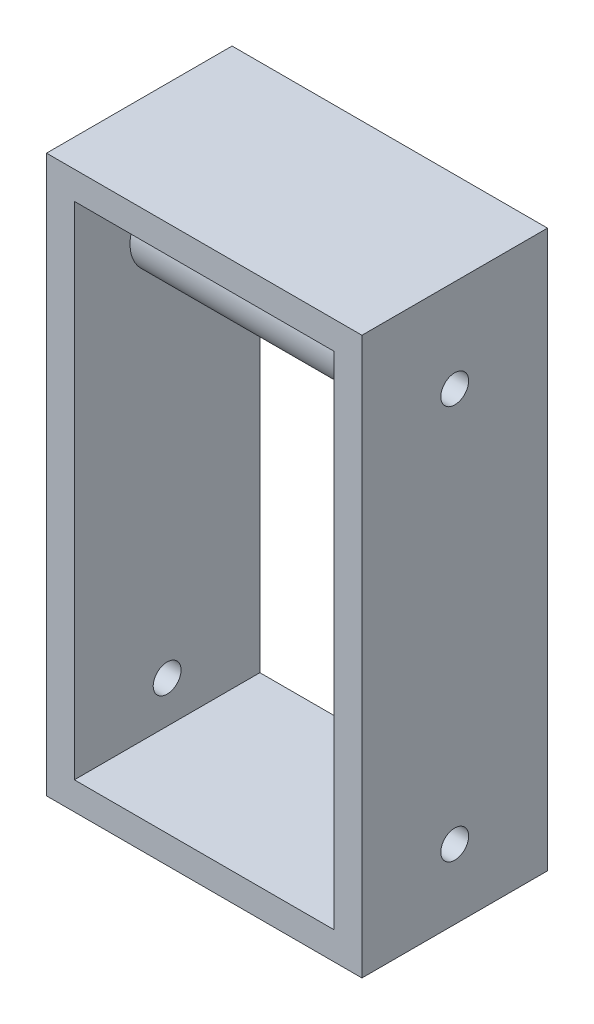
ISO-10303-21;
HEADER;
FILE_DESCRIPTION(('STEP AP214'),'2;1');
FILE_NAME('part.step','',(''),(''),'','','');
FILE_SCHEMA(('AUTOMOTIVE_DESIGN { 1 0 10303 214 1 1 1 1 }'));
ENDSEC;
DATA;
#1=APPLICATION_CONTEXT('core data for automotive mechanical design processes');
#2=APPLICATION_PROTOCOL_DEFINITION('international standard','automotive_design',2000,#1);
#3=PRODUCT_CONTEXT('',#1,'mechanical');
#4=PRODUCT('Part','Part','',(#3));
#5=PRODUCT_RELATED_PRODUCT_CATEGORY('part','',(#4));
#6=PRODUCT_DEFINITION_FORMATION('','',#4);
#7=PRODUCT_DEFINITION_CONTEXT('part definition',#1,'design');
#8=PRODUCT_DEFINITION('design','',#6,#7);
#9=PRODUCT_DEFINITION_SHAPE('','',#8);
#10=(LENGTH_UNIT() NAMED_UNIT(*) SI_UNIT(.MILLI.,.METRE.));
#11=(NAMED_UNIT(*) PLANE_ANGLE_UNIT() SI_UNIT($,.RADIAN.));
#12=(NAMED_UNIT(*) SI_UNIT($,.STERADIAN.) SOLID_ANGLE_UNIT());
#13=UNCERTAINTY_MEASURE_WITH_UNIT(LENGTH_MEASURE(1.E-05),#10,'distance_accuracy_value','');
#14=(GEOMETRIC_REPRESENTATION_CONTEXT(3) GLOBAL_UNCERTAINTY_ASSIGNED_CONTEXT((#13)) GLOBAL_UNIT_ASSIGNED_CONTEXT((#10,
#11,#12)) REPRESENTATION_CONTEXT('',''));
#15=CARTESIAN_POINT('',(0.,0.,0.));
#16=DIRECTION('',(0.,0.,1.));
#17=DIRECTION('',(1.,0.,0.));
#18=AXIS2_PLACEMENT_3D('',#15,#16,#17);
#19=CARTESIAN_POINT('',(0.,0.,20.));
#20=DIRECTION('',(0.,0.,1.));
#21=DIRECTION('',(1.,0.,0.));
#22=AXIS2_PLACEMENT_3D('',#19,#20,#21);
#23=PLANE('',#22);
#24=DIRECTION('',(0.,1.,0.));
#25=VECTOR('',#24,1.);
#26=CARTESIAN_POINT('',(17.,30.,20.));
#27=LINE('',#26,#25);
#28=CARTESIAN_POINT('',(17.,-30.,20.));
#29=VERTEX_POINT('',#28);
#30=CARTESIAN_POINT('',(17.,30.,20.));
#31=VERTEX_POINT('',#30);
#32=EDGE_CURVE('E156',#29,#31,#27,.T.);
#33=ORIENTED_EDGE('',*,*,#32,.T.);
#34=DIRECTION('',(-1.,0.,0.));
#35=VECTOR('',#34,1.);
#36=CARTESIAN_POINT('',(-17.,30.,20.));
#37=LINE('',#36,#35);
#38=CARTESIAN_POINT('',(-17.,30.,20.));
#39=VERTEX_POINT('',#38);
#40=EDGE_CURVE('E160',#31,#39,#37,.T.);
#41=ORIENTED_EDGE('',*,*,#40,.T.);
#42=DIRECTION('',(0.,-1.,0.));
#43=VECTOR('',#42,1.);
#44=CARTESIAN_POINT('',(-17.,30.,20.));
#45=LINE('',#44,#43);
#46=CARTESIAN_POINT('',(-17.,-30.,20.));
#47=VERTEX_POINT('',#46);
#48=EDGE_CURVE('E164',#39,#47,#45,.T.);
#49=ORIENTED_EDGE('',*,*,#48,.T.);
#50=DIRECTION('',(1.,0.,0.));
#51=VECTOR('',#50,1.);
#52=CARTESIAN_POINT('',(-17.,-30.,20.));
#53=LINE('',#52,#51);
#54=EDGE_CURVE('E167',#47,#29,#53,.T.);
#55=ORIENTED_EDGE('',*,*,#54,.T.);
#56=EDGE_LOOP('',(#33,#41,#49,#55));
#57=FACE_BOUND('',#56,.T.);
#58=DIRECTION('',(0.,-1.,0.));
#59=VECTOR('',#58,1.);
#60=CARTESIAN_POINT('',(-14.,27.,20.));
#61=LINE('',#60,#59);
#62=CARTESIAN_POINT('',(-14.,27.,20.));
#63=VERTEX_POINT('',#62);
#64=CARTESIAN_POINT('',(-14.,-27.,20.));
#65=VERTEX_POINT('',#64);
#66=EDGE_CURVE('E115',#63,#65,#61,.T.);
#67=ORIENTED_EDGE('',*,*,#66,.F.);
#68=DIRECTION('',(-1.,0.,0.));
#69=VECTOR('',#68,1.);
#70=CARTESIAN_POINT('',(-14.,27.,20.));
#71=LINE('',#70,#69);
#72=CARTESIAN_POINT('',(14.,27.,20.));
#73=VERTEX_POINT('',#72);
#74=EDGE_CURVE('E106',#73,#63,#71,.T.);
#75=ORIENTED_EDGE('',*,*,#74,.F.);
#76=DIRECTION('',(0.,1.,0.));
#77=VECTOR('',#76,1.);
#78=CARTESIAN_POINT('',(14.,27.,20.));
#79=LINE('',#78,#77);
#80=CARTESIAN_POINT('',(14.,-27.,20.));
#81=VERTEX_POINT('',#80);
#82=EDGE_CURVE('E132',#81,#73,#79,.T.);
#83=ORIENTED_EDGE('',*,*,#82,.F.);
#84=DIRECTION('',(1.,0.,0.));
#85=VECTOR('',#84,1.);
#86=CARTESIAN_POINT('',(-14.,-27.,20.));
#87=LINE('',#86,#85);
#88=EDGE_CURVE('E128',#65,#81,#87,.T.);
#89=ORIENTED_EDGE('',*,*,#88,.F.);
#90=EDGE_LOOP('',(#67,#75,#83,#89));
#91=FACE_BOUND('',#90,.T.);
#92=ADVANCED_FACE('F39',(#57,#91),#23,.T.);
#93=CARTESIAN_POINT('',(0.,0.,0.));
#94=DIRECTION('',(0.,0.,1.));
#95=DIRECTION('',(1.,0.,0.));
#96=AXIS2_PLACEMENT_3D('',#93,#94,#95);
#97=PLANE('',#96);
#98=DIRECTION('',(0.,1.,0.));
#99=VECTOR('',#98,1.);
#100=CARTESIAN_POINT('',(17.,30.,0.));
#101=LINE('',#100,#99);
#102=CARTESIAN_POINT('',(17.,-30.,0.));
#103=VERTEX_POINT('',#102);
#104=CARTESIAN_POINT('',(17.,30.,0.));
#105=VERTEX_POINT('',#104);
#106=EDGE_CURVE('E124',#103,#105,#101,.T.);
#107=ORIENTED_EDGE('',*,*,#106,.F.);
#108=DIRECTION('',(1.,0.,0.));
#109=VECTOR('',#108,1.);
#110=CARTESIAN_POINT('',(-17.,-30.,0.));
#111=LINE('',#110,#109);
#112=CARTESIAN_POINT('',(-17.,-30.,0.));
#113=VERTEX_POINT('',#112);
#114=EDGE_CURVE('E161',#113,#103,#111,.T.);
#115=ORIENTED_EDGE('',*,*,#114,.F.);
#116=DIRECTION('',(0.,-1.,0.));
#117=VECTOR('',#116,1.);
#118=CARTESIAN_POINT('',(-17.,30.,0.));
#119=LINE('',#118,#117);
#120=CARTESIAN_POINT('',(-17.,30.,0.));
#121=VERTEX_POINT('',#120);
#122=EDGE_CURVE('E177',#121,#113,#119,.T.);
#123=ORIENTED_EDGE('',*,*,#122,.F.);
#124=DIRECTION('',(-1.,0.,0.));
#125=VECTOR('',#124,1.);
#126=CARTESIAN_POINT('',(-17.,30.,0.));
#127=LINE('',#126,#125);
#128=EDGE_CURVE('E174',#105,#121,#127,.T.);
#129=ORIENTED_EDGE('',*,*,#128,.F.);
#130=EDGE_LOOP('',(#107,#115,#123,#129));
#131=FACE_BOUND('',#130,.T.);
#132=DIRECTION('',(-1.,0.,0.));
#133=VECTOR('',#132,1.);
#134=CARTESIAN_POINT('',(-14.,27.,0.));
#135=LINE('',#134,#133);
#136=CARTESIAN_POINT('',(14.,27.,0.));
#137=VERTEX_POINT('',#136);
#138=CARTESIAN_POINT('',(-14.,27.,0.));
#139=VERTEX_POINT('',#138);
#140=EDGE_CURVE('E64',#137,#139,#135,.T.);
#141=ORIENTED_EDGE('',*,*,#140,.T.);
#142=DIRECTION('',(0.,-1.,0.));
#143=VECTOR('',#142,1.);
#144=CARTESIAN_POINT('',(-14.,27.,0.));
#145=LINE('',#144,#143);
#146=CARTESIAN_POINT('',(-14.,-27.,0.));
#147=VERTEX_POINT('',#146);
#148=EDGE_CURVE('E122',#139,#147,#145,.T.);
#149=ORIENTED_EDGE('',*,*,#148,.T.);
#150=DIRECTION('',(1.,0.,0.));
#151=VECTOR('',#150,1.);
#152=CARTESIAN_POINT('',(-14.,-27.,0.));
#153=LINE('',#152,#151);
#154=CARTESIAN_POINT('',(14.,-27.,0.));
#155=VERTEX_POINT('',#154);
#156=EDGE_CURVE('E143',#147,#155,#153,.T.);
#157=ORIENTED_EDGE('',*,*,#156,.T.);
#158=DIRECTION('',(0.,1.,0.));
#159=VECTOR('',#158,1.);
#160=CARTESIAN_POINT('',(14.,27.,0.));
#161=LINE('',#160,#159);
#162=EDGE_CURVE('E116',#155,#137,#161,.T.);
#163=ORIENTED_EDGE('',*,*,#162,.T.);
#164=EDGE_LOOP('',(#141,#149,#157,#163));
#165=FACE_BOUND('',#164,.T.);
#166=ADVANCED_FACE('F201',(#131,#165),#97,.F.);
#167=CARTESIAN_POINT('',(17.,30.,20.));
#168=DIRECTION('',(-1.,0.,0.));
#169=DIRECTION('',(0.,-1.,0.));
#170=AXIS2_PLACEMENT_3D('',#167,#168,#169);
#171=PLANE('',#170);
#172=CARTESIAN_POINT('',(17.,-22.5,10.));
#173=DIRECTION('',(-1.,0.,0.));
#174=DIRECTION('',(0.,-1.,0.));
#175=AXIS2_PLACEMENT_3D('',#172,#173,#174);
#176=CIRCLE('',#175,1.5);
#177=CARTESIAN_POINT('',(17.,-24.,10.));
#178=VERTEX_POINT('',#177);
#179=EDGE_CURVE('E140',#178,#178,#176,.T.);
#180=ORIENTED_EDGE('',*,*,#179,.T.);
#181=EDGE_LOOP('',(#180));
#182=FACE_BOUND('',#181,.T.);
#183=CARTESIAN_POINT('',(17.,20.,10.));
#184=DIRECTION('',(-1.,0.,0.));
#185=DIRECTION('',(0.,-1.,0.));
#186=AXIS2_PLACEMENT_3D('',#183,#184,#185);
#187=CIRCLE('',#186,1.5);
#188=CARTESIAN_POINT('',(17.,18.5,10.));
#189=VERTEX_POINT('',#188);
#190=EDGE_CURVE('E298',#189,#189,#187,.T.);
#191=ORIENTED_EDGE('',*,*,#190,.T.);
#192=EDGE_LOOP('',(#191));
#193=FACE_BOUND('',#192,.T.);
#194=ORIENTED_EDGE('',*,*,#106,.T.);
#195=DIRECTION('',(0.,0.,-1.));
#196=VECTOR('',#195,1.);
#197=CARTESIAN_POINT('',(17.,30.,20.));
#198=LINE('',#197,#196);
#199=EDGE_CURVE('E11',#31,#105,#198,.T.);
#200=ORIENTED_EDGE('',*,*,#199,.F.);
#201=ORIENTED_EDGE('',*,*,#32,.F.);
#202=DIRECTION('',(0.,0.,-1.));
#203=VECTOR('',#202,1.);
#204=CARTESIAN_POINT('',(17.,-30.,20.));
#205=LINE('',#204,#203);
#206=EDGE_CURVE('E170',#29,#103,#205,.T.);
#207=ORIENTED_EDGE('',*,*,#206,.T.);
#208=EDGE_LOOP('',(#194,#200,#201,#207));
#209=FACE_BOUND('',#208,.T.);
#210=ADVANCED_FACE('F41',(#182,#193,#209),#171,.F.);
#211=CARTESIAN_POINT('',(-17.,30.,20.));
#212=DIRECTION('',(0.,-1.,0.));
#213=DIRECTION('',(0.,0.,-1.));
#214=AXIS2_PLACEMENT_3D('',#211,#212,#213);
#215=PLANE('',#214);
#216=ORIENTED_EDGE('',*,*,#128,.T.);
#217=DIRECTION('',(0.,0.,-1.));
#218=VECTOR('',#217,1.);
#219=CARTESIAN_POINT('',(-17.,30.,20.));
#220=LINE('',#219,#218);
#221=EDGE_CURVE('E49',#39,#121,#220,.T.);
#222=ORIENTED_EDGE('',*,*,#221,.F.);
#223=ORIENTED_EDGE('',*,*,#40,.F.);
#224=ORIENTED_EDGE('',*,*,#199,.T.);
#225=EDGE_LOOP('',(#216,#222,#223,#224));
#226=FACE_BOUND('',#225,.T.);
#227=ADVANCED_FACE('F211',(#226),#215,.F.);
#228=CARTESIAN_POINT('',(-17.,30.,20.));
#229=DIRECTION('',(1.,0.,0.));
#230=DIRECTION('',(0.,1.,0.));
#231=AXIS2_PLACEMENT_3D('',#228,#229,#230);
#232=PLANE('',#231);
#233=CARTESIAN_POINT('',(-17.,-22.5,10.));
#234=DIRECTION('',(1.,0.,0.));
#235=DIRECTION('',(0.,1.,0.));
#236=AXIS2_PLACEMENT_3D('',#233,#234,#235);
#237=CIRCLE('',#236,1.5);
#238=CARTESIAN_POINT('',(-17.,-21.,10.));
#239=VERTEX_POINT('',#238);
#240=EDGE_CURVE('E294',#239,#239,#237,.T.);
#241=ORIENTED_EDGE('',*,*,#240,.T.);
#242=EDGE_LOOP('',(#241));
#243=FACE_BOUND('',#242,.T.);
#244=CARTESIAN_POINT('',(-17.,20.,10.));
#245=DIRECTION('',(1.,0.,0.));
#246=DIRECTION('',(0.,1.,0.));
#247=AXIS2_PLACEMENT_3D('',#244,#245,#246);
#248=CIRCLE('',#247,1.5);
#249=CARTESIAN_POINT('',(-17.,21.5,10.));
#250=VERTEX_POINT('',#249);
#251=EDGE_CURVE('E287',#250,#250,#248,.T.);
#252=ORIENTED_EDGE('',*,*,#251,.T.);
#253=EDGE_LOOP('',(#252));
#254=FACE_BOUND('',#253,.T.);
#255=ORIENTED_EDGE('',*,*,#122,.T.);
#256=DIRECTION('',(0.,0.,-1.));
#257=VECTOR('',#256,1.);
#258=CARTESIAN_POINT('',(-17.,-30.,20.));
#259=LINE('',#258,#257);
#260=EDGE_CURVE('E185',#47,#113,#259,.T.);
#261=ORIENTED_EDGE('',*,*,#260,.F.);
#262=ORIENTED_EDGE('',*,*,#48,.F.);
#263=ORIENTED_EDGE('',*,*,#221,.T.);
#264=EDGE_LOOP('',(#255,#261,#262,#263));
#265=FACE_BOUND('',#264,.T.);
#266=ADVANCED_FACE('F195',(#243,#254,#265),#232,.F.);
#267=CARTESIAN_POINT('',(-17.,-30.,20.));
#268=DIRECTION('',(0.,1.,0.));
#269=DIRECTION('',(0.,0.,1.));
#270=AXIS2_PLACEMENT_3D('',#267,#268,#269);
#271=PLANE('',#270);
#272=ORIENTED_EDGE('',*,*,#114,.T.);
#273=ORIENTED_EDGE('',*,*,#206,.F.);
#274=ORIENTED_EDGE('',*,*,#54,.F.);
#275=ORIENTED_EDGE('',*,*,#260,.T.);
#276=EDGE_LOOP('',(#272,#273,#274,#275));
#277=FACE_BOUND('',#276,.T.);
#278=ADVANCED_FACE('F205',(#277),#271,.F.);
#279=CARTESIAN_POINT('',(-14.,27.,20.));
#280=DIRECTION('',(0.,-1.,0.));
#281=DIRECTION('',(0.,0.,-1.));
#282=AXIS2_PLACEMENT_3D('',#279,#280,#281);
#283=PLANE('',#282);
#284=ORIENTED_EDGE('',*,*,#140,.F.);
#285=DIRECTION('',(0.,0.,-1.));
#286=VECTOR('',#285,1.);
#287=CARTESIAN_POINT('',(14.,27.,20.));
#288=LINE('',#287,#286);
#289=EDGE_CURVE('E110',#73,#137,#288,.T.);
#290=ORIENTED_EDGE('',*,*,#289,.F.);
#291=ORIENTED_EDGE('',*,*,#74,.T.);
#292=DIRECTION('',(0.,0.,-1.));
#293=VECTOR('',#292,1.);
#294=CARTESIAN_POINT('',(-14.,27.,20.));
#295=LINE('',#294,#293);
#296=EDGE_CURVE('E109',#63,#139,#295,.T.);
#297=ORIENTED_EDGE('',*,*,#296,.T.);
#298=EDGE_LOOP('',(#284,#290,#291,#297));
#299=FACE_BOUND('',#298,.T.);
#300=ADVANCED_FACE('F108',(#299),#283,.T.);
#301=CARTESIAN_POINT('',(-14.,27.,20.));
#302=DIRECTION('',(1.,0.,0.));
#303=DIRECTION('',(0.,1.,0.));
#304=AXIS2_PLACEMENT_3D('',#301,#302,#303);
#305=PLANE('',#304);
#306=CARTESIAN_POINT('',(-14.,20.,10.));
#307=DIRECTION('',(1.,0.,0.));
#308=DIRECTION('',(0.,1.,0.));
#309=AXIS2_PLACEMENT_3D('',#306,#307,#308);
#310=CIRCLE('',#309,4.);
#311=CARTESIAN_POINT('',(-14.,24.,10.));
#312=VERTEX_POINT('',#311);
#313=EDGE_CURVE('E282',#312,#312,#310,.T.);
#314=ORIENTED_EDGE('',*,*,#313,.F.);
#315=EDGE_LOOP('',(#314));
#316=FACE_BOUND('',#315,.T.);
#317=CARTESIAN_POINT('',(-14.,-22.5,10.));
#318=DIRECTION('',(1.,0.,0.));
#319=DIRECTION('',(0.,1.,0.));
#320=AXIS2_PLACEMENT_3D('',#317,#318,#319);
#321=CIRCLE('',#320,1.5);
#322=CARTESIAN_POINT('',(-14.,-21.,10.));
#323=VERTEX_POINT('',#322);
#324=EDGE_CURVE('E305',#323,#323,#321,.T.);
#325=ORIENTED_EDGE('',*,*,#324,.F.);
#326=EDGE_LOOP('',(#325));
#327=FACE_BOUND('',#326,.T.);
#328=ORIENTED_EDGE('',*,*,#148,.F.);
#329=ORIENTED_EDGE('',*,*,#296,.F.);
#330=ORIENTED_EDGE('',*,*,#66,.T.);
#331=DIRECTION('',(0.,0.,-1.));
#332=VECTOR('',#331,1.);
#333=CARTESIAN_POINT('',(-14.,-27.,20.));
#334=LINE('',#333,#332);
#335=EDGE_CURVE('E125',#65,#147,#334,.T.);
#336=ORIENTED_EDGE('',*,*,#335,.T.);
#337=EDGE_LOOP('',(#328,#329,#330,#336));
#338=FACE_BOUND('',#337,.T.);
#339=ADVANCED_FACE('F119',(#316,#327,#338),#305,.T.);
#340=CARTESIAN_POINT('',(-14.,-27.,20.));
#341=DIRECTION('',(0.,1.,0.));
#342=DIRECTION('',(0.,0.,1.));
#343=AXIS2_PLACEMENT_3D('',#340,#341,#342);
#344=PLANE('',#343);
#345=ORIENTED_EDGE('',*,*,#156,.F.);
#346=ORIENTED_EDGE('',*,*,#335,.F.);
#347=ORIENTED_EDGE('',*,*,#88,.T.);
#348=DIRECTION('',(0.,0.,-1.));
#349=VECTOR('',#348,1.);
#350=CARTESIAN_POINT('',(14.,-27.,20.));
#351=LINE('',#350,#349);
#352=EDGE_CURVE('E56',#81,#155,#351,.T.);
#353=ORIENTED_EDGE('',*,*,#352,.T.);
#354=EDGE_LOOP('',(#345,#346,#347,#353));
#355=FACE_BOUND('',#354,.T.);
#356=ADVANCED_FACE('F237',(#355),#344,.T.);
#357=CARTESIAN_POINT('',(14.,27.,20.));
#358=DIRECTION('',(-1.,0.,0.));
#359=DIRECTION('',(0.,-1.,0.));
#360=AXIS2_PLACEMENT_3D('',#357,#358,#359);
#361=PLANE('',#360);
#362=CARTESIAN_POINT('',(14.,20.,10.));
#363=DIRECTION('',(-1.,0.,0.));
#364=DIRECTION('',(0.,-1.,0.));
#365=AXIS2_PLACEMENT_3D('',#362,#363,#364);
#366=CIRCLE('',#365,4.);
#367=CARTESIAN_POINT('',(14.,16.,10.));
#368=VERTEX_POINT('',#367);
#369=EDGE_CURVE('E290',#368,#368,#366,.T.);
#370=ORIENTED_EDGE('',*,*,#369,.F.);
#371=EDGE_LOOP('',(#370));
#372=FACE_BOUND('',#371,.T.);
#373=CARTESIAN_POINT('',(14.,-22.5,10.));
#374=DIRECTION('',(-1.,0.,0.));
#375=DIRECTION('',(0.,-1.,0.));
#376=AXIS2_PLACEMENT_3D('',#373,#374,#375);
#377=CIRCLE('',#376,1.5);
#378=CARTESIAN_POINT('',(14.,-24.,10.));
#379=VERTEX_POINT('',#378);
#380=EDGE_CURVE('E43',#379,#379,#377,.T.);
#381=ORIENTED_EDGE('',*,*,#380,.F.);
#382=EDGE_LOOP('',(#381));
#383=FACE_BOUND('',#382,.T.);
#384=ORIENTED_EDGE('',*,*,#162,.F.);
#385=ORIENTED_EDGE('',*,*,#352,.F.);
#386=ORIENTED_EDGE('',*,*,#82,.T.);
#387=ORIENTED_EDGE('',*,*,#289,.T.);
#388=EDGE_LOOP('',(#384,#385,#386,#387));
#389=FACE_BOUND('',#388,.T.);
#390=ADVANCED_FACE('F243',(#372,#383,#389),#361,.T.);
#391=CARTESIAN_POINT('',(-17.,20.,10.));
#392=DIRECTION('',(1.,0.,0.));
#393=DIRECTION('',(0.,1.,0.));
#394=AXIS2_PLACEMENT_3D('',#391,#392,#393);
#395=CYLINDRICAL_SURFACE('',#394,1.5);
#396=CARTESIAN_POINT('',(14.,20.,10.));
#397=DIRECTION('',(-1.,0.,0.));
#398=DIRECTION('',(0.,-1.,0.));
#399=AXIS2_PLACEMENT_3D('',#396,#397,#398);
#400=CIRCLE('',#399,1.5);
#401=CARTESIAN_POINT('',(14.,18.5,10.));
#402=VERTEX_POINT('',#401);
#403=EDGE_CURVE('E281',#402,#402,#400,.F.);
#404=ORIENTED_EDGE('',*,*,#403,.F.);
#405=EDGE_LOOP('',(#404));
#406=FACE_BOUND('',#405,.T.);
#407=ORIENTED_EDGE('',*,*,#190,.F.);
#408=EDGE_LOOP('',(#407));
#409=FACE_BOUND('',#408,.T.);
#410=ADVANCED_FACE('F250',(#406,#409),#395,.F.);
#411=CARTESIAN_POINT('',(-17.,-22.5,10.));
#412=DIRECTION('',(1.,0.,0.));
#413=DIRECTION('',(0.,1.,0.));
#414=AXIS2_PLACEMENT_3D('',#411,#412,#413);
#415=CYLINDRICAL_SURFACE('',#414,1.5);
#416=ORIENTED_EDGE('',*,*,#380,.T.);
#417=EDGE_LOOP('',(#416));
#418=FACE_BOUND('',#417,.T.);
#419=ORIENTED_EDGE('',*,*,#179,.F.);
#420=EDGE_LOOP('',(#419));
#421=FACE_BOUND('',#420,.T.);
#422=ADVANCED_FACE('F254',(#418,#421),#415,.F.);
#423=CARTESIAN_POINT('',(-14.,20.,10.));
#424=DIRECTION('',(1.,0.,0.));
#425=DIRECTION('',(0.,1.,0.));
#426=AXIS2_PLACEMENT_3D('',#423,#424,#425);
#427=CIRCLE('',#426,1.5);
#428=CARTESIAN_POINT('',(-14.,21.5,10.));
#429=VERTEX_POINT('',#428);
#430=EDGE_CURVE('E278',#429,#429,#427,.F.);
#431=ORIENTED_EDGE('',*,*,#430,.F.);
#432=EDGE_LOOP('',(#431));
#433=FACE_BOUND('',#432,.T.);
#434=ORIENTED_EDGE('',*,*,#251,.F.);
#435=EDGE_LOOP('',(#434));
#436=FACE_BOUND('',#435,.T.);
#437=ADVANCED_FACE('F256',(#433,#436),#395,.F.);
#438=ORIENTED_EDGE('',*,*,#324,.T.);
#439=EDGE_LOOP('',(#438));
#440=FACE_BOUND('',#439,.T.);
#441=ORIENTED_EDGE('',*,*,#240,.F.);
#442=EDGE_LOOP('',(#441));
#443=FACE_BOUND('',#442,.T.);
#444=ADVANCED_FACE('F260',(#440,#443),#415,.F.);
#445=CARTESIAN_POINT('',(-14.,27.,20.));
#446=DIRECTION('',(1.,0.,0.));
#447=DIRECTION('',(0.,1.,0.));
#448=AXIS2_PLACEMENT_3D('',#445,#446,#447);
#449=PLANE('',#448);
#450=ORIENTED_EDGE('',*,*,#430,.T.);
#451=EDGE_LOOP('',(#450));
#452=FACE_BOUND('',#451,.T.);
#453=ADVANCED_FACE('F268',(#452),#449,.F.);
#454=CARTESIAN_POINT('',(14.,20.,10.));
#455=DIRECTION('',(-1.,0.,0.));
#456=DIRECTION('',(0.,-1.,0.));
#457=AXIS2_PLACEMENT_3D('',#454,#455,#456);
#458=PLANE('',#457);
#459=ORIENTED_EDGE('',*,*,#403,.T.);
#460=EDGE_LOOP('',(#459));
#461=FACE_BOUND('',#460,.T.);
#462=ADVANCED_FACE('F264',(#461),#458,.F.);
#463=CARTESIAN_POINT('',(-25.3137084989848,20.,10.));
#464=DIRECTION('',(1.,0.,0.));
#465=DIRECTION('',(0.,1.,0.));
#466=AXIS2_PLACEMENT_3D('',#463,#464,#465);
#467=CYLINDRICAL_SURFACE('',#466,4.);
#468=ORIENTED_EDGE('',*,*,#313,.T.);
#469=EDGE_LOOP('',(#468));
#470=FACE_BOUND('',#469,.T.);
#471=ORIENTED_EDGE('',*,*,#369,.T.);
#472=EDGE_LOOP('',(#471));
#473=FACE_BOUND('',#472,.T.);
#474=ADVANCED_FACE('F261',(#470,#473),#467,.T.);
#475=CLOSED_SHELL('',(#92,#166,#210,#227,#266,#278,#300,#339,#356,#390,#410,#422,#437,#444,#453,
#462,#474));
#476=MANIFOLD_SOLID_BREP('B2',#475);
#477=ADVANCED_BREP_SHAPE_REPRESENTATION('',(#18,#476),#14);
#478=SHAPE_DEFINITION_REPRESENTATION(#9,#477);
ENDSEC;
END-ISO-10303-21;
